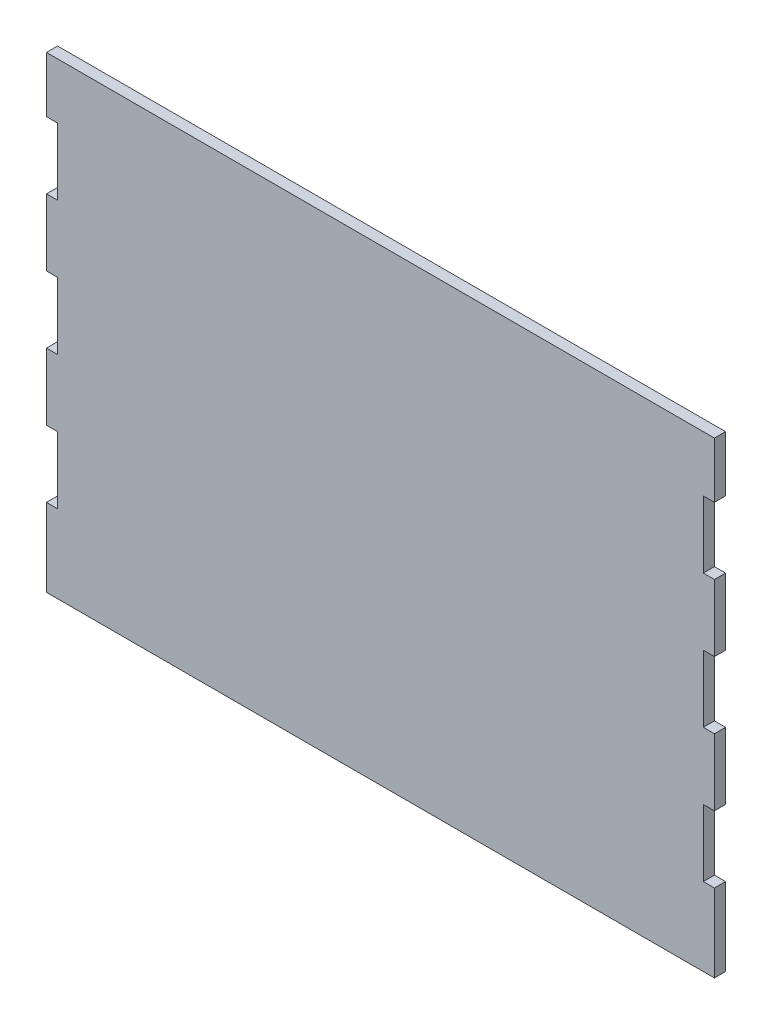
ISO-10303-21;
HEADER;
FILE_DESCRIPTION(('STEP AP214'),'2;1');
FILE_NAME('part.step','',(''),(''),'','','');
FILE_SCHEMA(('AUTOMOTIVE_DESIGN { 1 0 10303 214 1 1 1 1 }'));
ENDSEC;
DATA;
#1=APPLICATION_CONTEXT('core data for automotive mechanical design processes');
#2=APPLICATION_PROTOCOL_DEFINITION('international standard','automotive_design',2000,#1);
#3=PRODUCT_CONTEXT('',#1,'mechanical');
#4=PRODUCT('Part','Part','',(#3));
#5=PRODUCT_RELATED_PRODUCT_CATEGORY('part','',(#4));
#6=PRODUCT_DEFINITION_FORMATION('','',#4);
#7=PRODUCT_DEFINITION_CONTEXT('part definition',#1,'design');
#8=PRODUCT_DEFINITION('design','',#6,#7);
#9=PRODUCT_DEFINITION_SHAPE('','',#8);
#10=(LENGTH_UNIT() NAMED_UNIT(*) SI_UNIT(.MILLI.,.METRE.));
#11=(NAMED_UNIT(*) PLANE_ANGLE_UNIT() SI_UNIT($,.RADIAN.));
#12=(NAMED_UNIT(*) SI_UNIT($,.STERADIAN.) SOLID_ANGLE_UNIT());
#13=UNCERTAINTY_MEASURE_WITH_UNIT(LENGTH_MEASURE(1.E-05),#10,'distance_accuracy_value','');
#14=(GEOMETRIC_REPRESENTATION_CONTEXT(3) GLOBAL_UNCERTAINTY_ASSIGNED_CONTEXT((#13)) GLOBAL_UNIT_ASSIGNED_CONTEXT((#10,
#11,#12)) REPRESENTATION_CONTEXT('',''));
#15=CARTESIAN_POINT('',(0.,0.,0.));
#16=DIRECTION('',(0.,0.,1.));
#17=DIRECTION('',(1.,0.,0.));
#18=AXIS2_PLACEMENT_3D('',#15,#16,#17);
#19=CARTESIAN_POINT('',(150.,105.,5.));
#20=DIRECTION('',(-1.,0.,0.));
#21=DIRECTION('',(0.,-1.,0.));
#22=AXIS2_PLACEMENT_3D('',#19,#20,#21);
#23=PLANE('',#22);
#24=DIRECTION('',(0.,1.,0.));
#25=VECTOR('',#24,1.);
#26=CARTESIAN_POINT('',(150.,105.,0.));
#27=LINE('',#26,#25);
#28=CARTESIAN_POINT('',(150.,-40.,0.));
#29=VERTEX_POINT('',#28);
#30=CARTESIAN_POINT('',(150.,-10.,0.));
#31=VERTEX_POINT('',#30);
#32=EDGE_CURVE('E464',#29,#31,#27,.T.);
#33=ORIENTED_EDGE('',*,*,#32,.T.);
#34=DIRECTION('',(0.,0.,1.));
#35=VECTOR('',#34,1.);
#36=CARTESIAN_POINT('',(150.,-10.,5.));
#37=LINE('',#36,#35);
#38=CARTESIAN_POINT('',(150.,-10.,5.));
#39=VERTEX_POINT('',#38);
#40=EDGE_CURVE('E435',#31,#39,#37,.T.);
#41=ORIENTED_EDGE('',*,*,#40,.T.);
#42=DIRECTION('',(0.,1.,0.));
#43=VECTOR('',#42,1.);
#44=CARTESIAN_POINT('',(150.,105.,5.));
#45=LINE('',#44,#43);
#46=CARTESIAN_POINT('',(150.,-40.,5.));
#47=VERTEX_POINT('',#46);
#48=EDGE_CURVE('E445',#47,#39,#45,.T.);
#49=ORIENTED_EDGE('',*,*,#48,.F.);
#50=DIRECTION('',(0.,0.,-1.));
#51=VECTOR('',#50,1.);
#52=CARTESIAN_POINT('',(150.,-40.,5.));
#53=LINE('',#52,#51);
#54=EDGE_CURVE('E423',#47,#29,#53,.T.);
#55=ORIENTED_EDGE('',*,*,#54,.T.);
#56=EDGE_LOOP('',(#33,#41,#49,#55));
#57=FACE_BOUND('',#56,.T.);
#58=ADVANCED_FACE('F41',(#57),#23,.F.);
#59=CARTESIAN_POINT('',(150.,-105.,0.));
#60=VERTEX_POINT('',#59);
#61=CARTESIAN_POINT('',(150.,-70.,0.));
#62=VERTEX_POINT('',#61);
#63=EDGE_CURVE('E459',#60,#62,#27,.T.);
#64=ORIENTED_EDGE('',*,*,#63,.T.);
#65=DIRECTION('',(0.,0.,1.));
#66=VECTOR('',#65,1.);
#67=CARTESIAN_POINT('',(150.,-70.,5.));
#68=LINE('',#67,#66);
#69=CARTESIAN_POINT('',(150.,-70.,5.));
#70=VERTEX_POINT('',#69);
#71=EDGE_CURVE('E427',#62,#70,#68,.T.);
#72=ORIENTED_EDGE('',*,*,#71,.T.);
#73=CARTESIAN_POINT('',(150.,-105.,5.));
#74=VERTEX_POINT('',#73);
#75=EDGE_CURVE('E440',#74,#70,#45,.T.);
#76=ORIENTED_EDGE('',*,*,#75,.F.);
#77=DIRECTION('',(0.,0.,-1.));
#78=VECTOR('',#77,1.);
#79=CARTESIAN_POINT('',(150.,-105.,5.));
#80=LINE('',#79,#78);
#81=EDGE_CURVE('E458',#74,#60,#80,.T.);
#82=ORIENTED_EDGE('',*,*,#81,.T.);
#83=EDGE_LOOP('',(#64,#72,#76,#82));
#84=FACE_BOUND('',#83,.T.);
#85=ADVANCED_FACE('F513',(#84),#23,.F.);
#86=CARTESIAN_POINT('',(150.,20.,5.));
#87=VERTEX_POINT('',#86);
#88=CARTESIAN_POINT('',(150.,50.,5.));
#89=VERTEX_POINT('',#88);
#90=EDGE_CURVE('E594',#87,#89,#45,.T.);
#91=ORIENTED_EDGE('',*,*,#90,.F.);
#92=DIRECTION('',(0.,0.,-1.));
#93=VECTOR('',#92,1.);
#94=CARTESIAN_POINT('',(150.,20.,5.));
#95=LINE('',#94,#93);
#96=CARTESIAN_POINT('',(150.,20.,0.));
#97=VERTEX_POINT('',#96);
#98=EDGE_CURVE('E431',#87,#97,#95,.T.);
#99=ORIENTED_EDGE('',*,*,#98,.T.);
#100=CARTESIAN_POINT('',(150.,50.,0.));
#101=VERTEX_POINT('',#100);
#102=EDGE_CURVE('E576',#97,#101,#27,.T.);
#103=ORIENTED_EDGE('',*,*,#102,.T.);
#104=DIRECTION('',(0.,0.,1.));
#105=VECTOR('',#104,1.);
#106=CARTESIAN_POINT('',(150.,50.,5.));
#107=LINE('',#106,#105);
#108=EDGE_CURVE('E396',#101,#89,#107,.T.);
#109=ORIENTED_EDGE('',*,*,#108,.T.);
#110=EDGE_LOOP('',(#91,#99,#103,#109));
#111=FACE_BOUND('',#110,.T.);
#112=ADVANCED_FACE('F562',(#111),#23,.F.);
#113=CARTESIAN_POINT('',(-150.,105.,5.));
#114=DIRECTION('',(1.,0.,0.));
#115=DIRECTION('',(0.,1.,0.));
#116=AXIS2_PLACEMENT_3D('',#113,#114,#115);
#117=PLANE('',#116);
#118=DIRECTION('',(0.,-1.,0.));
#119=VECTOR('',#118,1.);
#120=CARTESIAN_POINT('',(-150.,105.,5.));
#121=LINE('',#120,#119);
#122=CARTESIAN_POINT('',(-150.,50.,5.));
#123=VERTEX_POINT('',#122);
#124=CARTESIAN_POINT('',(-150.,20.,5.));
#125=VERTEX_POINT('',#124);
#126=EDGE_CURVE('E455',#123,#125,#121,.T.);
#127=ORIENTED_EDGE('',*,*,#126,.F.);
#128=DIRECTION('',(0.,0.,-1.));
#129=VECTOR('',#128,1.);
#130=CARTESIAN_POINT('',(-150.,50.,5.));
#131=LINE('',#130,#129);
#132=CARTESIAN_POINT('',(-150.,50.,0.));
#133=VERTEX_POINT('',#132);
#134=EDGE_CURVE('E419',#123,#133,#131,.T.);
#135=ORIENTED_EDGE('',*,*,#134,.T.);
#136=DIRECTION('',(0.,-1.,0.));
#137=VECTOR('',#136,1.);
#138=CARTESIAN_POINT('',(-150.,105.,0.));
#139=LINE('',#138,#137);
#140=CARTESIAN_POINT('',(-150.,20.,0.));
#141=VERTEX_POINT('',#140);
#142=EDGE_CURVE('E473',#133,#141,#139,.T.);
#143=ORIENTED_EDGE('',*,*,#142,.T.);
#144=DIRECTION('',(0.,0.,1.));
#145=VECTOR('',#144,1.);
#146=CARTESIAN_POINT('',(-150.,20.,5.));
#147=LINE('',#146,#145);
#148=EDGE_CURVE('E407',#141,#125,#147,.T.);
#149=ORIENTED_EDGE('',*,*,#148,.T.);
#150=EDGE_LOOP('',(#127,#135,#143,#149));
#151=FACE_BOUND('',#150,.T.);
#152=ADVANCED_FACE('F534',(#151),#117,.F.);
#153=CARTESIAN_POINT('',(-150.,-10.,5.));
#154=VERTEX_POINT('',#153);
#155=CARTESIAN_POINT('',(-150.,-40.,5.));
#156=VERTEX_POINT('',#155);
#157=EDGE_CURVE('E256',#154,#156,#121,.T.);
#158=ORIENTED_EDGE('',*,*,#157,.F.);
#159=DIRECTION('',(0.,0.,-1.));
#160=VECTOR('',#159,1.);
#161=CARTESIAN_POINT('',(-150.,-10.,5.));
#162=LINE('',#161,#160);
#163=CARTESIAN_POINT('',(-150.,-10.,0.));
#164=VERTEX_POINT('',#163);
#165=EDGE_CURVE('E411',#154,#164,#162,.T.);
#166=ORIENTED_EDGE('',*,*,#165,.T.);
#167=CARTESIAN_POINT('',(-150.,-40.,0.));
#168=VERTEX_POINT('',#167);
#169=EDGE_CURVE('E524',#164,#168,#139,.T.);
#170=ORIENTED_EDGE('',*,*,#169,.T.);
#171=DIRECTION('',(0.,0.,1.));
#172=VECTOR('',#171,1.);
#173=CARTESIAN_POINT('',(-150.,-40.,5.));
#174=LINE('',#173,#172);
#175=EDGE_CURVE('E400',#168,#156,#174,.T.);
#176=ORIENTED_EDGE('',*,*,#175,.T.);
#177=EDGE_LOOP('',(#158,#166,#170,#176));
#178=FACE_BOUND('',#177,.T.);
#179=ADVANCED_FACE('F553',(#178),#117,.F.);
#180=CARTESIAN_POINT('',(-150.,-70.,5.));
#181=VERTEX_POINT('',#180);
#182=CARTESIAN_POINT('',(-150.,-105.,5.));
#183=VERTEX_POINT('',#182);
#184=EDGE_CURVE('E449',#181,#183,#121,.T.);
#185=ORIENTED_EDGE('',*,*,#184,.F.);
#186=DIRECTION('',(0.,0.,-1.));
#187=VECTOR('',#186,1.);
#188=CARTESIAN_POINT('',(-150.,-70.,5.));
#189=LINE('',#188,#187);
#190=CARTESIAN_POINT('',(-150.,-70.,0.));
#191=VERTEX_POINT('',#190);
#192=EDGE_CURVE('E403',#181,#191,#189,.T.);
#193=ORIENTED_EDGE('',*,*,#192,.T.);
#194=CARTESIAN_POINT('',(-150.,-105.,0.));
#195=VERTEX_POINT('',#194);
#196=EDGE_CURVE('E467',#191,#195,#139,.T.);
#197=ORIENTED_EDGE('',*,*,#196,.T.);
#198=DIRECTION('',(0.,0.,-1.));
#199=VECTOR('',#198,1.);
#200=CARTESIAN_POINT('',(-150.,-105.,5.));
#201=LINE('',#200,#199);
#202=EDGE_CURVE('E479',#183,#195,#201,.T.);
#203=ORIENTED_EDGE('',*,*,#202,.F.);
#204=EDGE_LOOP('',(#185,#193,#197,#203));
#205=FACE_BOUND('',#204,.T.);
#206=ADVANCED_FACE('F551',(#205),#117,.F.);
#207=CARTESIAN_POINT('',(150.,80.,5.));
#208=VERTEX_POINT('',#207);
#209=CARTESIAN_POINT('',(150.,105.,5.));
#210=VERTEX_POINT('',#209);
#211=EDGE_CURVE('E446',#208,#210,#45,.T.);
#212=ORIENTED_EDGE('',*,*,#211,.F.);
#213=DIRECTION('',(0.,0.,-1.));
#214=VECTOR('',#213,1.);
#215=CARTESIAN_POINT('',(150.,80.,5.));
#216=LINE('',#215,#214);
#217=CARTESIAN_POINT('',(150.,80.,0.));
#218=VERTEX_POINT('',#217);
#219=EDGE_CURVE('E389',#208,#218,#216,.T.);
#220=ORIENTED_EDGE('',*,*,#219,.T.);
#221=CARTESIAN_POINT('',(150.,105.,0.));
#222=VERTEX_POINT('',#221);
#223=EDGE_CURVE('E439',#218,#222,#27,.T.);
#224=ORIENTED_EDGE('',*,*,#223,.T.);
#225=DIRECTION('',(0.,0.,-1.));
#226=VECTOR('',#225,1.);
#227=CARTESIAN_POINT('',(150.,105.,5.));
#228=LINE('',#227,#226);
#229=EDGE_CURVE('E487',#210,#222,#228,.T.);
#230=ORIENTED_EDGE('',*,*,#229,.F.);
#231=EDGE_LOOP('',(#212,#220,#224,#230));
#232=FACE_BOUND('',#231,.T.);
#233=ADVANCED_FACE('F43',(#232),#23,.F.);
#234=CARTESIAN_POINT('',(-150.,105.,5.));
#235=DIRECTION('',(0.,-1.,0.));
#236=DIRECTION('',(0.,0.,-1.));
#237=AXIS2_PLACEMENT_3D('',#234,#235,#236);
#238=PLANE('',#237);
#239=DIRECTION('',(-1.,0.,0.));
#240=VECTOR('',#239,1.);
#241=CARTESIAN_POINT('',(-150.,105.,0.));
#242=LINE('',#241,#240);
#243=CARTESIAN_POINT('',(-150.,105.,0.));
#244=VERTEX_POINT('',#243);
#245=EDGE_CURVE('E463',#222,#244,#242,.T.);
#246=ORIENTED_EDGE('',*,*,#245,.T.);
#247=DIRECTION('',(0.,0.,-1.));
#248=VECTOR('',#247,1.);
#249=CARTESIAN_POINT('',(-150.,105.,5.));
#250=LINE('',#249,#248);
#251=CARTESIAN_POINT('',(-150.,105.,5.));
#252=VERTEX_POINT('',#251);
#253=EDGE_CURVE('E483',#252,#244,#250,.T.);
#254=ORIENTED_EDGE('',*,*,#253,.F.);
#255=DIRECTION('',(-1.,0.,0.));
#256=VECTOR('',#255,1.);
#257=CARTESIAN_POINT('',(-150.,105.,5.));
#258=LINE('',#257,#256);
#259=EDGE_CURVE('E444',#210,#252,#258,.T.);
#260=ORIENTED_EDGE('',*,*,#259,.F.);
#261=ORIENTED_EDGE('',*,*,#229,.T.);
#262=EDGE_LOOP('',(#246,#254,#260,#261));
#263=FACE_BOUND('',#262,.T.);
#264=ADVANCED_FACE('F560',(#263),#238,.F.);
#265=CARTESIAN_POINT('',(-150.,80.,0.));
#266=VERTEX_POINT('',#265);
#267=EDGE_CURVE('E468',#244,#266,#139,.T.);
#268=ORIENTED_EDGE('',*,*,#267,.T.);
#269=DIRECTION('',(0.,0.,1.));
#270=VECTOR('',#269,1.);
#271=CARTESIAN_POINT('',(-150.,80.,5.));
#272=LINE('',#271,#270);
#273=CARTESIAN_POINT('',(-150.,80.,5.));
#274=VERTEX_POINT('',#273);
#275=EDGE_CURVE('E415',#266,#274,#272,.T.);
#276=ORIENTED_EDGE('',*,*,#275,.T.);
#277=EDGE_CURVE('E450',#252,#274,#121,.T.);
#278=ORIENTED_EDGE('',*,*,#277,.F.);
#279=ORIENTED_EDGE('',*,*,#253,.T.);
#280=EDGE_LOOP('',(#268,#276,#278,#279));
#281=FACE_BOUND('',#280,.T.);
#282=ADVANCED_FACE('F555',(#281),#117,.F.);
#283=CARTESIAN_POINT('',(-150.,-105.,5.));
#284=DIRECTION('',(0.,1.,0.));
#285=DIRECTION('',(0.,0.,1.));
#286=AXIS2_PLACEMENT_3D('',#283,#284,#285);
#287=PLANE('',#286);
#288=DIRECTION('',(1.,0.,0.));
#289=VECTOR('',#288,1.);
#290=CARTESIAN_POINT('',(-150.,-105.,0.));
#291=LINE('',#290,#289);
#292=EDGE_CURVE('E472',#195,#60,#291,.T.);
#293=ORIENTED_EDGE('',*,*,#292,.T.);
#294=ORIENTED_EDGE('',*,*,#81,.F.);
#295=DIRECTION('',(1.,0.,0.));
#296=VECTOR('',#295,1.);
#297=CARTESIAN_POINT('',(-150.,-105.,5.));
#298=LINE('',#297,#296);
#299=EDGE_CURVE('E454',#183,#74,#298,.T.);
#300=ORIENTED_EDGE('',*,*,#299,.F.);
#301=ORIENTED_EDGE('',*,*,#202,.T.);
#302=EDGE_LOOP('',(#293,#294,#300,#301));
#303=FACE_BOUND('',#302,.T.);
#304=ADVANCED_FACE('F518',(#303),#287,.F.);
#305=CARTESIAN_POINT('',(0.,0.,5.));
#306=DIRECTION('',(0.,0.,1.));
#307=DIRECTION('',(1.,0.,0.));
#308=AXIS2_PLACEMENT_3D('',#305,#306,#307);
#309=PLANE('',#308);
#310=DIRECTION('',(-1.,0.,0.));
#311=VECTOR('',#310,1.);
#312=CARTESIAN_POINT('',(217.619836515583,-10.,5.));
#313=LINE('',#312,#311);
#314=CARTESIAN_POINT('',(145.,-10.,5.));
#315=VERTEX_POINT('',#314);
#316=EDGE_CURVE('E280',#39,#315,#313,.T.);
#317=ORIENTED_EDGE('',*,*,#316,.T.);
#318=DIRECTION('',(0.,1.,0.));
#319=VECTOR('',#318,1.);
#320=CARTESIAN_POINT('',(145.,20.,5.));
#321=LINE('',#320,#319);
#322=CARTESIAN_POINT('',(145.,20.,5.));
#323=VERTEX_POINT('',#322);
#324=EDGE_CURVE('E271',#315,#323,#321,.T.);
#325=ORIENTED_EDGE('',*,*,#324,.T.);
#326=DIRECTION('',(1.,0.,0.));
#327=VECTOR('',#326,1.);
#328=CARTESIAN_POINT('',(217.619836515583,20.,5.));
#329=LINE('',#328,#327);
#330=EDGE_CURVE('E275',#323,#87,#329,.T.);
#331=ORIENTED_EDGE('',*,*,#330,.T.);
#332=ORIENTED_EDGE('',*,*,#90,.T.);
#333=DIRECTION('',(-1.,0.,0.));
#334=VECTOR('',#333,1.);
#335=CARTESIAN_POINT('',(212.619836515583,50.,5.));
#336=LINE('',#335,#334);
#337=CARTESIAN_POINT('',(145.,50.,5.));
#338=VERTEX_POINT('',#337);
#339=EDGE_CURVE('E376',#89,#338,#336,.T.);
#340=ORIENTED_EDGE('',*,*,#339,.T.);
#341=DIRECTION('',(0.,1.,0.));
#342=VECTOR('',#341,1.);
#343=CARTESIAN_POINT('',(145.,80.,5.));
#344=LINE('',#343,#342);
#345=CARTESIAN_POINT('',(145.,80.,5.));
#346=VERTEX_POINT('',#345);
#347=EDGE_CURVE('E367',#338,#346,#344,.T.);
#348=ORIENTED_EDGE('',*,*,#347,.T.);
#349=DIRECTION('',(1.,0.,0.));
#350=VECTOR('',#349,1.);
#351=CARTESIAN_POINT('',(212.619836515583,80.,5.));
#352=LINE('',#351,#350);
#353=EDGE_CURVE('E371',#346,#208,#352,.T.);
#354=ORIENTED_EDGE('',*,*,#353,.T.);
#355=ORIENTED_EDGE('',*,*,#211,.T.);
#356=ORIENTED_EDGE('',*,*,#259,.T.);
#357=ORIENTED_EDGE('',*,*,#277,.T.);
#358=DIRECTION('',(1.,0.,0.));
#359=VECTOR('',#358,1.);
#360=CARTESIAN_POINT('',(-145.,80.,5.));
#361=LINE('',#360,#359);
#362=CARTESIAN_POINT('',(-145.,80.,5.));
#363=VERTEX_POINT('',#362);
#364=EDGE_CURVE('E318',#274,#363,#361,.T.);
#365=ORIENTED_EDGE('',*,*,#364,.T.);
#366=DIRECTION('',(0.,-1.,0.));
#367=VECTOR('',#366,1.);
#368=CARTESIAN_POINT('',(-145.,80.,5.));
#369=LINE('',#368,#367);
#370=CARTESIAN_POINT('',(-145.,50.,5.));
#371=VERTEX_POINT('',#370);
#372=EDGE_CURVE('E322',#363,#371,#369,.T.);
#373=ORIENTED_EDGE('',*,*,#372,.T.);
#374=DIRECTION('',(-1.,0.,0.));
#375=VECTOR('',#374,1.);
#376=CARTESIAN_POINT('',(-145.,50.,5.));
#377=LINE('',#376,#375);
#378=EDGE_CURVE('E327',#371,#123,#377,.T.);
#379=ORIENTED_EDGE('',*,*,#378,.T.);
#380=ORIENTED_EDGE('',*,*,#126,.T.);
#381=DIRECTION('',(1.,0.,0.));
#382=VECTOR('',#381,1.);
#383=CARTESIAN_POINT('',(-145.,20.,5.));
#384=LINE('',#383,#382);
#385=CARTESIAN_POINT('',(-145.,20.,5.));
#386=VERTEX_POINT('',#385);
#387=EDGE_CURVE('E344',#125,#386,#384,.T.);
#388=ORIENTED_EDGE('',*,*,#387,.T.);
#389=DIRECTION('',(0.,-1.,0.));
#390=VECTOR('',#389,1.);
#391=CARTESIAN_POINT('',(-145.,20.,5.));
#392=LINE('',#391,#390);
#393=CARTESIAN_POINT('',(-145.,-10.,5.));
#394=VERTEX_POINT('',#393);
#395=EDGE_CURVE('E348',#386,#394,#392,.T.);
#396=ORIENTED_EDGE('',*,*,#395,.T.);
#397=DIRECTION('',(-1.,0.,0.));
#398=VECTOR('',#397,1.);
#399=CARTESIAN_POINT('',(-145.,-10.,5.));
#400=LINE('',#399,#398);
#401=EDGE_CURVE('E353',#394,#154,#400,.T.);
#402=ORIENTED_EDGE('',*,*,#401,.T.);
#403=ORIENTED_EDGE('',*,*,#157,.T.);
#404=DIRECTION('',(1.,0.,0.));
#405=VECTOR('',#404,1.);
#406=CARTESIAN_POINT('',(-145.,-40.,5.));
#407=LINE('',#406,#405);
#408=CARTESIAN_POINT('',(-145.,-40.,5.));
#409=VERTEX_POINT('',#408);
#410=EDGE_CURVE('E232',#156,#409,#407,.T.);
#411=ORIENTED_EDGE('',*,*,#410,.T.);
#412=DIRECTION('',(0.,-1.,0.));
#413=VECTOR('',#412,1.);
#414=CARTESIAN_POINT('',(-145.,-70.,5.));
#415=LINE('',#414,#413);
#416=CARTESIAN_POINT('',(-145.,-70.,5.));
#417=VERTEX_POINT('',#416);
#418=EDGE_CURVE('E244',#409,#417,#415,.T.);
#419=ORIENTED_EDGE('',*,*,#418,.T.);
#420=DIRECTION('',(-1.,0.,0.));
#421=VECTOR('',#420,1.);
#422=CARTESIAN_POINT('',(-145.,-70.,5.));
#423=LINE('',#422,#421);
#424=EDGE_CURVE('E241',#417,#181,#423,.T.);
#425=ORIENTED_EDGE('',*,*,#424,.T.);
#426=ORIENTED_EDGE('',*,*,#184,.T.);
#427=ORIENTED_EDGE('',*,*,#299,.T.);
#428=ORIENTED_EDGE('',*,*,#75,.T.);
#429=DIRECTION('',(-1.,0.,0.));
#430=VECTOR('',#429,1.);
#431=CARTESIAN_POINT('',(217.619836515583,-70.,5.));
#432=LINE('',#431,#430);
#433=CARTESIAN_POINT('',(145.,-70.,5.));
#434=VERTEX_POINT('',#433);
#435=EDGE_CURVE('E304',#70,#434,#432,.T.);
#436=ORIENTED_EDGE('',*,*,#435,.T.);
#437=DIRECTION('',(0.,1.,0.));
#438=VECTOR('',#437,1.);
#439=CARTESIAN_POINT('',(145.,-70.,5.));
#440=LINE('',#439,#438);
#441=CARTESIAN_POINT('',(145.,-40.,5.));
#442=VERTEX_POINT('',#441);
#443=EDGE_CURVE('E295',#434,#442,#440,.T.);
#444=ORIENTED_EDGE('',*,*,#443,.T.);
#445=DIRECTION('',(1.,0.,0.));
#446=VECTOR('',#445,1.);
#447=CARTESIAN_POINT('',(217.619836515583,-40.,5.));
#448=LINE('',#447,#446);
#449=EDGE_CURVE('E299',#442,#47,#448,.T.);
#450=ORIENTED_EDGE('',*,*,#449,.T.);
#451=ORIENTED_EDGE('',*,*,#48,.T.);
#452=EDGE_LOOP('',(#317,#325,#331,#332,#340,#348,#354,#355,#356,#357,#365,#373,#379,#380,#388,
#396,#402,#403,#411,#419,#425,#426,#427,#428,#436,#444,#450,#451));
#453=FACE_BOUND('',#452,.T.);
#454=ADVANCED_FACE('F253',(#453),#309,.T.);
#455=CARTESIAN_POINT('',(0.,0.,0.));
#456=DIRECTION('',(0.,0.,1.));
#457=DIRECTION('',(1.,0.,0.));
#458=AXIS2_PLACEMENT_3D('',#455,#456,#457);
#459=PLANE('',#458);
#460=DIRECTION('',(0.,1.,0.));
#461=VECTOR('',#460,1.);
#462=CARTESIAN_POINT('',(145.,20.,0.));
#463=LINE('',#462,#461);
#464=CARTESIAN_POINT('',(145.,-10.,0.));
#465=VERTEX_POINT('',#464);
#466=CARTESIAN_POINT('',(145.,20.,0.));
#467=VERTEX_POINT('',#466);
#468=EDGE_CURVE('E57',#465,#467,#463,.T.);
#469=ORIENTED_EDGE('',*,*,#468,.F.);
#470=DIRECTION('',(1.,0.,0.));
#471=VECTOR('',#470,1.);
#472=CARTESIAN_POINT('',(0.,-10.,0.));
#473=LINE('',#472,#471);
#474=EDGE_CURVE('E11',#465,#31,#473,.T.);
#475=ORIENTED_EDGE('',*,*,#474,.T.);
#476=ORIENTED_EDGE('',*,*,#32,.F.);
#477=DIRECTION('',(1.,0.,0.));
#478=VECTOR('',#477,1.);
#479=CARTESIAN_POINT('',(217.619836515583,-40.,0.));
#480=LINE('',#479,#478);
#481=CARTESIAN_POINT('',(145.,-40.,0.));
#482=VERTEX_POINT('',#481);
#483=EDGE_CURVE('E300',#482,#29,#480,.T.);
#484=ORIENTED_EDGE('',*,*,#483,.F.);
#485=DIRECTION('',(0.,1.,0.));
#486=VECTOR('',#485,1.);
#487=CARTESIAN_POINT('',(145.,-70.,0.));
#488=LINE('',#487,#486);
#489=CARTESIAN_POINT('',(145.,-70.,0.));
#490=VERTEX_POINT('',#489);
#491=EDGE_CURVE('E65',#490,#482,#488,.T.);
#492=ORIENTED_EDGE('',*,*,#491,.F.);
#493=DIRECTION('',(1.,0.,0.));
#494=VECTOR('',#493,1.);
#495=CARTESIAN_POINT('',(0.,-70.,0.));
#496=LINE('',#495,#494);
#497=EDGE_CURVE('E50',#490,#62,#496,.T.);
#498=ORIENTED_EDGE('',*,*,#497,.T.);
#499=ORIENTED_EDGE('',*,*,#63,.F.);
#500=ORIENTED_EDGE('',*,*,#292,.F.);
#501=ORIENTED_EDGE('',*,*,#196,.F.);
#502=DIRECTION('',(-1.,0.,0.));
#503=VECTOR('',#502,1.);
#504=CARTESIAN_POINT('',(-145.,-70.,0.));
#505=LINE('',#504,#503);
#506=CARTESIAN_POINT('',(-145.,-70.,0.));
#507=VERTEX_POINT('',#506);
#508=EDGE_CURVE('E258',#507,#191,#505,.T.);
#509=ORIENTED_EDGE('',*,*,#508,.F.);
#510=DIRECTION('',(0.,-1.,0.));
#511=VECTOR('',#510,1.);
#512=CARTESIAN_POINT('',(-145.,-70.,0.));
#513=LINE('',#512,#511);
#514=CARTESIAN_POINT('',(-145.,-40.,0.));
#515=VERTEX_POINT('',#514);
#516=EDGE_CURVE('E261',#515,#507,#513,.T.);
#517=ORIENTED_EDGE('',*,*,#516,.F.);
#518=DIRECTION('',(-1.,0.,0.));
#519=VECTOR('',#518,1.);
#520=CARTESIAN_POINT('',(0.,-40.,0.));
#521=LINE('',#520,#519);
#522=EDGE_CURVE('E235',#515,#168,#521,.T.);
#523=ORIENTED_EDGE('',*,*,#522,.T.);
#524=ORIENTED_EDGE('',*,*,#169,.F.);
#525=DIRECTION('',(-1.,0.,0.));
#526=VECTOR('',#525,1.);
#527=CARTESIAN_POINT('',(-145.,-10.,0.));
#528=LINE('',#527,#526);
#529=CARTESIAN_POINT('',(-145.,-10.,0.));
#530=VERTEX_POINT('',#529);
#531=EDGE_CURVE('E349',#530,#164,#528,.T.);
#532=ORIENTED_EDGE('',*,*,#531,.F.);
#533=DIRECTION('',(0.,-1.,0.));
#534=VECTOR('',#533,1.);
#535=CARTESIAN_POINT('',(-145.,20.,0.));
#536=LINE('',#535,#534);
#537=CARTESIAN_POINT('',(-145.,20.,0.));
#538=VERTEX_POINT('',#537);
#539=EDGE_CURVE('E269',#538,#530,#536,.T.);
#540=ORIENTED_EDGE('',*,*,#539,.F.);
#541=DIRECTION('',(-1.,0.,0.));
#542=VECTOR('',#541,1.);
#543=CARTESIAN_POINT('',(0.,20.,0.));
#544=LINE('',#543,#542);
#545=EDGE_CURVE('E497',#538,#141,#544,.T.);
#546=ORIENTED_EDGE('',*,*,#545,.T.);
#547=ORIENTED_EDGE('',*,*,#142,.F.);
#548=DIRECTION('',(-1.,0.,0.));
#549=VECTOR('',#548,1.);
#550=CARTESIAN_POINT('',(-145.,50.,0.));
#551=LINE('',#550,#549);
#552=CARTESIAN_POINT('',(-145.,50.,0.));
#553=VERTEX_POINT('',#552);
#554=EDGE_CURVE('E323',#553,#133,#551,.T.);
#555=ORIENTED_EDGE('',*,*,#554,.F.);
#556=DIRECTION('',(0.,-1.,0.));
#557=VECTOR('',#556,1.);
#558=CARTESIAN_POINT('',(-145.,80.,0.));
#559=LINE('',#558,#557);
#560=CARTESIAN_POINT('',(-145.,80.,0.));
#561=VERTEX_POINT('',#560);
#562=EDGE_CURVE('E332',#561,#553,#559,.T.);
#563=ORIENTED_EDGE('',*,*,#562,.F.);
#564=DIRECTION('',(-1.,0.,0.));
#565=VECTOR('',#564,1.);
#566=CARTESIAN_POINT('',(0.,80.,0.));
#567=LINE('',#566,#565);
#568=EDGE_CURVE('E501',#561,#266,#567,.T.);
#569=ORIENTED_EDGE('',*,*,#568,.T.);
#570=ORIENTED_EDGE('',*,*,#267,.F.);
#571=ORIENTED_EDGE('',*,*,#245,.F.);
#572=ORIENTED_EDGE('',*,*,#223,.F.);
#573=DIRECTION('',(1.,0.,0.));
#574=VECTOR('',#573,1.);
#575=CARTESIAN_POINT('',(212.619836515583,80.,0.));
#576=LINE('',#575,#574);
#577=CARTESIAN_POINT('',(145.,80.,0.));
#578=VERTEX_POINT('',#577);
#579=EDGE_CURVE('E372',#578,#218,#576,.T.);
#580=ORIENTED_EDGE('',*,*,#579,.F.);
#581=DIRECTION('',(0.,1.,0.));
#582=VECTOR('',#581,1.);
#583=CARTESIAN_POINT('',(145.,80.,0.));
#584=LINE('',#583,#582);
#585=CARTESIAN_POINT('',(145.,50.,0.));
#586=VERTEX_POINT('',#585);
#587=EDGE_CURVE('E292',#586,#578,#584,.T.);
#588=ORIENTED_EDGE('',*,*,#587,.F.);
#589=DIRECTION('',(1.,0.,0.));
#590=VECTOR('',#589,1.);
#591=CARTESIAN_POINT('',(0.,50.,0.));
#592=LINE('',#591,#590);
#593=EDGE_CURVE('E491',#586,#101,#592,.T.);
#594=ORIENTED_EDGE('',*,*,#593,.T.);
#595=ORIENTED_EDGE('',*,*,#102,.F.);
#596=DIRECTION('',(1.,0.,0.));
#597=VECTOR('',#596,1.);
#598=CARTESIAN_POINT('',(217.619836515583,20.,0.));
#599=LINE('',#598,#597);
#600=EDGE_CURVE('E276',#467,#97,#599,.T.);
#601=ORIENTED_EDGE('',*,*,#600,.F.);
#602=EDGE_LOOP('',(#469,#475,#476,#484,#492,#498,#499,#500,#501,#509,#517,#523,#524,#532,#540,
#546,#547,#555,#563,#569,#570,#571,#572,#580,#588,#594,#595,#601));
#603=FACE_BOUND('',#602,.T.);
#604=ADVANCED_FACE('F508',(#603),#459,.F.);
#605=CARTESIAN_POINT('',(212.619836515583,50.,5.));
#606=DIRECTION('',(0.,-1.,0.));
#607=DIRECTION('',(0.,0.,-1.));
#608=AXIS2_PLACEMENT_3D('',#605,#606,#607);
#609=PLANE('',#608);
#610=ORIENTED_EDGE('',*,*,#593,.F.);
#611=DIRECTION('',(0.,0.,-1.));
#612=VECTOR('',#611,1.);
#613=CARTESIAN_POINT('',(145.,50.,5.));
#614=LINE('',#613,#612);
#615=EDGE_CURVE('E385',#338,#586,#614,.T.);
#616=ORIENTED_EDGE('',*,*,#615,.F.);
#617=ORIENTED_EDGE('',*,*,#339,.F.);
#618=ORIENTED_EDGE('',*,*,#108,.F.);
#619=EDGE_LOOP('',(#610,#616,#617,#618));
#620=FACE_BOUND('',#619,.T.);
#621=ADVANCED_FACE('F638',(#620),#609,.F.);
#622=CARTESIAN_POINT('',(212.619836515583,80.,5.));
#623=DIRECTION('',(0.,1.,0.));
#624=DIRECTION('',(0.,0.,1.));
#625=AXIS2_PLACEMENT_3D('',#622,#623,#624);
#626=PLANE('',#625);
#627=ORIENTED_EDGE('',*,*,#353,.F.);
#628=DIRECTION('',(0.,0.,-1.));
#629=VECTOR('',#628,1.);
#630=CARTESIAN_POINT('',(145.,80.,5.));
#631=LINE('',#630,#629);
#632=EDGE_CURVE('E380',#346,#578,#631,.T.);
#633=ORIENTED_EDGE('',*,*,#632,.T.);
#634=ORIENTED_EDGE('',*,*,#579,.T.);
#635=ORIENTED_EDGE('',*,*,#219,.F.);
#636=EDGE_LOOP('',(#627,#633,#634,#635));
#637=FACE_BOUND('',#636,.T.);
#638=ADVANCED_FACE('F641',(#637),#626,.F.);
#639=CARTESIAN_POINT('',(145.,80.,5.));
#640=DIRECTION('',(-1.,0.,0.));
#641=DIRECTION('',(0.,0.,1.));
#642=AXIS2_PLACEMENT_3D('',#639,#640,#641);
#643=PLANE('',#642);
#644=ORIENTED_EDGE('',*,*,#587,.T.);
#645=ORIENTED_EDGE('',*,*,#632,.F.);
#646=ORIENTED_EDGE('',*,*,#347,.F.);
#647=ORIENTED_EDGE('',*,*,#615,.T.);
#648=EDGE_LOOP('',(#644,#645,#646,#647));
#649=FACE_BOUND('',#648,.T.);
#650=ADVANCED_FACE('F645',(#649),#643,.F.);
#651=CARTESIAN_POINT('',(-145.,-70.,5.));
#652=DIRECTION('',(0.,-1.,0.));
#653=DIRECTION('',(0.,0.,-1.));
#654=AXIS2_PLACEMENT_3D('',#651,#652,#653);
#655=PLANE('',#654);
#656=ORIENTED_EDGE('',*,*,#424,.F.);
#657=DIRECTION('',(0.,0.,-1.));
#658=VECTOR('',#657,1.);
#659=CARTESIAN_POINT('',(-145.,-70.,5.));
#660=LINE('',#659,#658);
#661=EDGE_CURVE('E240',#417,#507,#660,.T.);
#662=ORIENTED_EDGE('',*,*,#661,.T.);
#663=ORIENTED_EDGE('',*,*,#508,.T.);
#664=ORIENTED_EDGE('',*,*,#192,.F.);
#665=EDGE_LOOP('',(#656,#662,#663,#664));
#666=FACE_BOUND('',#665,.T.);
#667=ADVANCED_FACE('F649',(#666),#655,.F.);
#668=CARTESIAN_POINT('',(-145.,-40.,5.));
#669=DIRECTION('',(0.,1.,0.));
#670=DIRECTION('',(0.,0.,1.));
#671=AXIS2_PLACEMENT_3D('',#668,#669,#670);
#672=PLANE('',#671);
#673=ORIENTED_EDGE('',*,*,#522,.F.);
#674=DIRECTION('',(0.,0.,-1.));
#675=VECTOR('',#674,1.);
#676=CARTESIAN_POINT('',(-145.,-40.,5.));
#677=LINE('',#676,#675);
#678=EDGE_CURVE('E228',#409,#515,#677,.T.);
#679=ORIENTED_EDGE('',*,*,#678,.F.);
#680=ORIENTED_EDGE('',*,*,#410,.F.);
#681=ORIENTED_EDGE('',*,*,#175,.F.);
#682=EDGE_LOOP('',(#673,#679,#680,#681));
#683=FACE_BOUND('',#682,.T.);
#684=ADVANCED_FACE('F230',(#683),#672,.F.);
#685=CARTESIAN_POINT('',(-145.,-70.,5.));
#686=DIRECTION('',(1.,0.,0.));
#687=DIRECTION('',(0.,0.,-1.));
#688=AXIS2_PLACEMENT_3D('',#685,#686,#687);
#689=PLANE('',#688);
#690=ORIENTED_EDGE('',*,*,#516,.T.);
#691=ORIENTED_EDGE('',*,*,#661,.F.);
#692=ORIENTED_EDGE('',*,*,#418,.F.);
#693=ORIENTED_EDGE('',*,*,#678,.T.);
#694=EDGE_LOOP('',(#690,#691,#692,#693));
#695=FACE_BOUND('',#694,.T.);
#696=ADVANCED_FACE('F245',(#695),#689,.F.);
#697=CARTESIAN_POINT('',(-145.,-10.,5.));
#698=DIRECTION('',(0.,-1.,0.));
#699=DIRECTION('',(0.,0.,-1.));
#700=AXIS2_PLACEMENT_3D('',#697,#698,#699);
#701=PLANE('',#700);
#702=ORIENTED_EDGE('',*,*,#401,.F.);
#703=DIRECTION('',(0.,0.,-1.));
#704=VECTOR('',#703,1.);
#705=CARTESIAN_POINT('',(-145.,-10.,5.));
#706=LINE('',#705,#704);
#707=EDGE_CURVE('E336',#394,#530,#706,.T.);
#708=ORIENTED_EDGE('',*,*,#707,.T.);
#709=ORIENTED_EDGE('',*,*,#531,.T.);
#710=ORIENTED_EDGE('',*,*,#165,.F.);
#711=EDGE_LOOP('',(#702,#708,#709,#710));
#712=FACE_BOUND('',#711,.T.);
#713=ADVANCED_FACE('F630',(#712),#701,.F.);
#714=CARTESIAN_POINT('',(-145.,20.,5.));
#715=DIRECTION('',(0.,1.,0.));
#716=DIRECTION('',(0.,0.,1.));
#717=AXIS2_PLACEMENT_3D('',#714,#715,#716);
#718=PLANE('',#717);
#719=ORIENTED_EDGE('',*,*,#545,.F.);
#720=DIRECTION('',(0.,0.,-1.));
#721=VECTOR('',#720,1.);
#722=CARTESIAN_POINT('',(-145.,20.,5.));
#723=LINE('',#722,#721);
#724=EDGE_CURVE('E356',#386,#538,#723,.T.);
#725=ORIENTED_EDGE('',*,*,#724,.F.);
#726=ORIENTED_EDGE('',*,*,#387,.F.);
#727=ORIENTED_EDGE('',*,*,#148,.F.);
#728=EDGE_LOOP('',(#719,#725,#726,#727));
#729=FACE_BOUND('',#728,.T.);
#730=ADVANCED_FACE('F541',(#729),#718,.F.);
#731=CARTESIAN_POINT('',(-145.,20.,5.));
#732=DIRECTION('',(1.,0.,0.));
#733=DIRECTION('',(0.,0.,-1.));
#734=AXIS2_PLACEMENT_3D('',#731,#732,#733);
#735=PLANE('',#734);
#736=ORIENTED_EDGE('',*,*,#539,.T.);
#737=ORIENTED_EDGE('',*,*,#707,.F.);
#738=ORIENTED_EDGE('',*,*,#395,.F.);
#739=ORIENTED_EDGE('',*,*,#724,.T.);
#740=EDGE_LOOP('',(#736,#737,#738,#739));
#741=FACE_BOUND('',#740,.T.);
#742=ADVANCED_FACE('F544',(#741),#735,.F.);
#743=CARTESIAN_POINT('',(-145.,50.,5.));
#744=DIRECTION('',(0.,-1.,0.));
#745=DIRECTION('',(0.,0.,-1.));
#746=AXIS2_PLACEMENT_3D('',#743,#744,#745);
#747=PLANE('',#746);
#748=ORIENTED_EDGE('',*,*,#378,.F.);
#749=DIRECTION('',(0.,0.,-1.));
#750=VECTOR('',#749,1.);
#751=CARTESIAN_POINT('',(-145.,50.,5.));
#752=LINE('',#751,#750);
#753=EDGE_CURVE('E311',#371,#553,#752,.T.);
#754=ORIENTED_EDGE('',*,*,#753,.T.);
#755=ORIENTED_EDGE('',*,*,#554,.T.);
#756=ORIENTED_EDGE('',*,*,#134,.F.);
#757=EDGE_LOOP('',(#748,#754,#755,#756));
#758=FACE_BOUND('',#757,.T.);
#759=ADVANCED_FACE('F623',(#758),#747,.F.);
#760=CARTESIAN_POINT('',(-145.,80.,5.));
#761=DIRECTION('',(0.,1.,0.));
#762=DIRECTION('',(0.,0.,1.));
#763=AXIS2_PLACEMENT_3D('',#760,#761,#762);
#764=PLANE('',#763);
#765=ORIENTED_EDGE('',*,*,#568,.F.);
#766=DIRECTION('',(0.,0.,-1.));
#767=VECTOR('',#766,1.);
#768=CARTESIAN_POINT('',(-145.,80.,5.));
#769=LINE('',#768,#767);
#770=EDGE_CURVE('E331',#363,#561,#769,.T.);
#771=ORIENTED_EDGE('',*,*,#770,.F.);
#772=ORIENTED_EDGE('',*,*,#364,.F.);
#773=ORIENTED_EDGE('',*,*,#275,.F.);
#774=EDGE_LOOP('',(#765,#771,#772,#773));
#775=FACE_BOUND('',#774,.T.);
#776=ADVANCED_FACE('F613',(#775),#764,.F.);
#777=CARTESIAN_POINT('',(-145.,80.,5.));
#778=DIRECTION('',(1.,0.,0.));
#779=DIRECTION('',(0.,1.,0.));
#780=AXIS2_PLACEMENT_3D('',#777,#778,#779);
#781=PLANE('',#780);
#782=ORIENTED_EDGE('',*,*,#562,.T.);
#783=ORIENTED_EDGE('',*,*,#753,.F.);
#784=ORIENTED_EDGE('',*,*,#372,.F.);
#785=ORIENTED_EDGE('',*,*,#770,.T.);
#786=EDGE_LOOP('',(#782,#783,#784,#785));
#787=FACE_BOUND('',#786,.T.);
#788=ADVANCED_FACE('F606',(#787),#781,.F.);
#789=CARTESIAN_POINT('',(217.619836515583,-70.,5.));
#790=DIRECTION('',(0.,-1.,0.));
#791=DIRECTION('',(0.,0.,-1.));
#792=AXIS2_PLACEMENT_3D('',#789,#790,#791);
#793=PLANE('',#792);
#794=ORIENTED_EDGE('',*,*,#497,.F.);
#795=DIRECTION('',(0.,0.,-1.));
#796=VECTOR('',#795,1.);
#797=CARTESIAN_POINT('',(145.,-70.,5.));
#798=LINE('',#797,#796);
#799=EDGE_CURVE('E286',#434,#490,#798,.T.);
#800=ORIENTED_EDGE('',*,*,#799,.F.);
#801=ORIENTED_EDGE('',*,*,#435,.F.);
#802=ORIENTED_EDGE('',*,*,#71,.F.);
#803=EDGE_LOOP('',(#794,#800,#801,#802));
#804=FACE_BOUND('',#803,.T.);
#805=ADVANCED_FACE('F604',(#804),#793,.F.);
#806=CARTESIAN_POINT('',(217.619836515583,-40.,5.));
#807=DIRECTION('',(0.,1.,0.));
#808=DIRECTION('',(0.,0.,1.));
#809=AXIS2_PLACEMENT_3D('',#806,#807,#808);
#810=PLANE('',#809);
#811=ORIENTED_EDGE('',*,*,#449,.F.);
#812=DIRECTION('',(0.,0.,-1.));
#813=VECTOR('',#812,1.);
#814=CARTESIAN_POINT('',(145.,-40.,5.));
#815=LINE('',#814,#813);
#816=EDGE_CURVE('E308',#442,#482,#815,.T.);
#817=ORIENTED_EDGE('',*,*,#816,.T.);
#818=ORIENTED_EDGE('',*,*,#483,.T.);
#819=ORIENTED_EDGE('',*,*,#54,.F.);
#820=EDGE_LOOP('',(#811,#817,#818,#819));
#821=FACE_BOUND('',#820,.T.);
#822=ADVANCED_FACE('F602',(#821),#810,.F.);
#823=CARTESIAN_POINT('',(145.,-70.,5.));
#824=DIRECTION('',(-1.,0.,0.));
#825=DIRECTION('',(0.,0.,1.));
#826=AXIS2_PLACEMENT_3D('',#823,#824,#825);
#827=PLANE('',#826);
#828=ORIENTED_EDGE('',*,*,#491,.T.);
#829=ORIENTED_EDGE('',*,*,#816,.F.);
#830=ORIENTED_EDGE('',*,*,#443,.F.);
#831=ORIENTED_EDGE('',*,*,#799,.T.);
#832=EDGE_LOOP('',(#828,#829,#830,#831));
#833=FACE_BOUND('',#832,.T.);
#834=ADVANCED_FACE('F603',(#833),#827,.F.);
#835=CARTESIAN_POINT('',(217.619836515583,-10.,5.));
#836=DIRECTION('',(0.,-1.,0.));
#837=DIRECTION('',(0.,0.,-1.));
#838=AXIS2_PLACEMENT_3D('',#835,#836,#837);
#839=PLANE('',#838);
#840=ORIENTED_EDGE('',*,*,#474,.F.);
#841=DIRECTION('',(0.,0.,-1.));
#842=VECTOR('',#841,1.);
#843=CARTESIAN_POINT('',(145.,-10.,5.));
#844=LINE('',#843,#842);
#845=EDGE_CURVE('E289',#315,#465,#844,.T.);
#846=ORIENTED_EDGE('',*,*,#845,.F.);
#847=ORIENTED_EDGE('',*,*,#316,.F.);
#848=ORIENTED_EDGE('',*,*,#40,.F.);
#849=EDGE_LOOP('',(#840,#846,#847,#848));
#850=FACE_BOUND('',#849,.T.);
#851=ADVANCED_FACE('F622',(#850),#839,.F.);
#852=CARTESIAN_POINT('',(217.619836515583,20.,5.));
#853=DIRECTION('',(0.,1.,0.));
#854=DIRECTION('',(0.,0.,1.));
#855=AXIS2_PLACEMENT_3D('',#852,#853,#854);
#856=PLANE('',#855);
#857=ORIENTED_EDGE('',*,*,#330,.F.);
#858=DIRECTION('',(0.,0.,-1.));
#859=VECTOR('',#858,1.);
#860=CARTESIAN_POINT('',(145.,20.,5.));
#861=LINE('',#860,#859);
#862=EDGE_CURVE('E283',#323,#467,#861,.T.);
#863=ORIENTED_EDGE('',*,*,#862,.T.);
#864=ORIENTED_EDGE('',*,*,#600,.T.);
#865=ORIENTED_EDGE('',*,*,#98,.F.);
#866=EDGE_LOOP('',(#857,#863,#864,#865));
#867=FACE_BOUND('',#866,.T.);
#868=ADVANCED_FACE('F749',(#867),#856,.F.);
#869=CARTESIAN_POINT('',(145.,20.,5.));
#870=DIRECTION('',(-1.,0.,0.));
#871=DIRECTION('',(0.,0.,1.));
#872=AXIS2_PLACEMENT_3D('',#869,#870,#871);
#873=PLANE('',#872);
#874=ORIENTED_EDGE('',*,*,#468,.T.);
#875=ORIENTED_EDGE('',*,*,#862,.F.);
#876=ORIENTED_EDGE('',*,*,#324,.F.);
#877=ORIENTED_EDGE('',*,*,#845,.T.);
#878=EDGE_LOOP('',(#874,#875,#876,#877));
#879=FACE_BOUND('',#878,.T.);
#880=ADVANCED_FACE('F617',(#879),#873,.F.);
#881=CLOSED_SHELL('',(#58,#85,#112,#152,#179,#206,#233,#264,#282,#304,#454,#604,#621,#638,#650,
#667,#684,#696,#713,#730,#742,#759,#776,#788,#805,#822,#834,#851,#868,#880));
#882=MANIFOLD_SOLID_BREP('B2',#881);
#883=ADVANCED_BREP_SHAPE_REPRESENTATION('',(#18,#882),#14);
#884=SHAPE_DEFINITION_REPRESENTATION(#9,#883);
ENDSEC;
END-ISO-10303-21;
